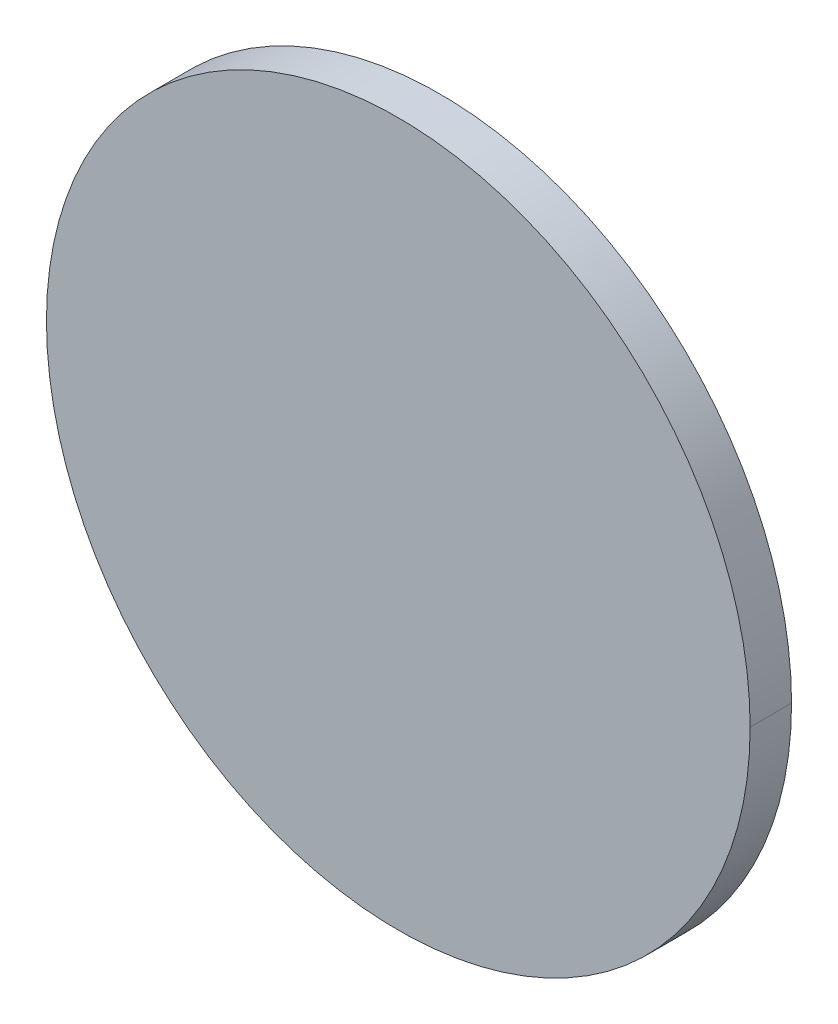
ISO-10303-21;
HEADER;
FILE_DESCRIPTION(('STEP AP214'),'2;1');
FILE_NAME('part.step','',(''),(''),'','','');
FILE_SCHEMA(('AUTOMOTIVE_DESIGN { 1 0 10303 214 1 1 1 1 }'));
ENDSEC;
DATA;
#1=APPLICATION_CONTEXT('core data for automotive mechanical design processes');
#2=APPLICATION_PROTOCOL_DEFINITION('international standard','automotive_design',2000,#1);
#3=PRODUCT_CONTEXT('',#1,'mechanical');
#4=PRODUCT('Part','Part','',(#3));
#5=PRODUCT_RELATED_PRODUCT_CATEGORY('part','',(#4));
#6=PRODUCT_DEFINITION_FORMATION('','',#4);
#7=PRODUCT_DEFINITION_CONTEXT('part definition',#1,'design');
#8=PRODUCT_DEFINITION('design','',#6,#7);
#9=PRODUCT_DEFINITION_SHAPE('','',#8);
#10=(LENGTH_UNIT() NAMED_UNIT(*) SI_UNIT(.MILLI.,.METRE.));
#11=(NAMED_UNIT(*) PLANE_ANGLE_UNIT() SI_UNIT($,.RADIAN.));
#12=(NAMED_UNIT(*) SI_UNIT($,.STERADIAN.) SOLID_ANGLE_UNIT());
#13=UNCERTAINTY_MEASURE_WITH_UNIT(LENGTH_MEASURE(1.E-05),#10,'distance_accuracy_value','');
#14=(GEOMETRIC_REPRESENTATION_CONTEXT(3) GLOBAL_UNCERTAINTY_ASSIGNED_CONTEXT((#13)) GLOBAL_UNIT_ASSIGNED_CONTEXT((#10,
#11,#12)) REPRESENTATION_CONTEXT('',''));
#15=CARTESIAN_POINT('',(0.,0.,0.));
#16=DIRECTION('',(0.,0.,1.));
#17=DIRECTION('',(1.,0.,0.));
#18=AXIS2_PLACEMENT_3D('',#15,#16,#17);
#19=CARTESIAN_POINT('',(24.65,20.,12.5208152801713));
#20=DIRECTION('',(0.,0.,-1.));
#21=DIRECTION('',(-1.,0.,0.));
#22=AXIS2_PLACEMENT_3D('',#19,#20,#21);
#23=CYLINDRICAL_SURFACE('',#22,4.25);
#24=CARTESIAN_POINT('',(24.65,20.,0.5));
#25=DIRECTION('',(0.,0.,-1.));
#26=DIRECTION('',(-1.,0.,0.));
#27=AXIS2_PLACEMENT_3D('',#24,#25,#26);
#28=CIRCLE('',#27,4.25);
#29=CARTESIAN_POINT('',(20.4,20.,0.5));
#30=VERTEX_POINT('',#29);
#31=CARTESIAN_POINT('',(28.9,20.,0.5));
#32=VERTEX_POINT('',#31);
#33=EDGE_CURVE('E11',#30,#32,#28,.T.);
#34=ORIENTED_EDGE('',*,*,#33,.T.);
#35=DIRECTION('',(0.,0.,-1.));
#36=VECTOR('',#35,1.);
#37=CARTESIAN_POINT('',(28.9,20.,12.5208152801713));
#38=LINE('',#37,#36);
#39=CARTESIAN_POINT('',(28.9,20.,0.));
#40=VERTEX_POINT('',#39);
#41=EDGE_CURVE('E27',#32,#40,#38,.T.);
#42=ORIENTED_EDGE('',*,*,#41,.T.);
#43=CARTESIAN_POINT('',(24.65,20.,0.));
#44=DIRECTION('',(0.,0.,1.));
#45=DIRECTION('',(1.,0.,0.));
#46=AXIS2_PLACEMENT_3D('',#43,#44,#45);
#47=CIRCLE('',#46,4.25);
#48=CARTESIAN_POINT('',(20.4,20.,0.));
#49=VERTEX_POINT('',#48);
#50=EDGE_CURVE('E60',#40,#49,#47,.T.);
#51=ORIENTED_EDGE('',*,*,#50,.T.);
#52=DIRECTION('',(0.,0.,-1.));
#53=VECTOR('',#52,1.);
#54=CARTESIAN_POINT('',(20.4,20.,12.5208152801713));
#55=LINE('',#54,#53);
#56=EDGE_CURVE('E50',#30,#49,#55,.T.);
#57=ORIENTED_EDGE('',*,*,#56,.F.);
#58=EDGE_LOOP('',(#34,#42,#51,#57));
#59=FACE_BOUND('',#58,.T.);
#60=ADVANCED_FACE('F16',(#59),#23,.T.);
#61=CARTESIAN_POINT('',(24.65,20.,0.));
#62=DIRECTION('',(0.,0.,1.));
#63=DIRECTION('',(1.,0.,0.));
#64=AXIS2_PLACEMENT_3D('',#61,#62,#63);
#65=PLANE('',#64);
#66=CARTESIAN_POINT('',(24.65,20.,0.));
#67=DIRECTION('',(0.,0.,1.));
#68=DIRECTION('',(1.,0.,0.));
#69=AXIS2_PLACEMENT_3D('',#66,#67,#68);
#70=CIRCLE('',#69,4.25);
#71=EDGE_CURVE('E54',#49,#40,#70,.T.);
#72=ORIENTED_EDGE('',*,*,#71,.F.);
#73=ORIENTED_EDGE('',*,*,#50,.F.);
#74=EDGE_LOOP('',(#72,#73));
#75=FACE_BOUND('',#74,.T.);
#76=ADVANCED_FACE('F18',(#75),#65,.F.);
#77=CARTESIAN_POINT('',(24.65,20.,12.5208152801713));
#78=DIRECTION('',(0.,0.,-1.));
#79=DIRECTION('',(-1.,0.,0.));
#80=AXIS2_PLACEMENT_3D('',#77,#78,#79);
#81=CYLINDRICAL_SURFACE('',#80,4.25);
#82=ORIENTED_EDGE('',*,*,#41,.F.);
#83=CARTESIAN_POINT('',(24.65,20.,0.5));
#84=DIRECTION('',(0.,0.,-1.));
#85=DIRECTION('',(-1.,0.,0.));
#86=AXIS2_PLACEMENT_3D('',#83,#84,#85);
#87=CIRCLE('',#86,4.25);
#88=EDGE_CURVE('E20',#32,#30,#87,.T.);
#89=ORIENTED_EDGE('',*,*,#88,.T.);
#90=ORIENTED_EDGE('',*,*,#56,.T.);
#91=ORIENTED_EDGE('',*,*,#71,.T.);
#92=EDGE_LOOP('',(#82,#89,#90,#91));
#93=FACE_BOUND('',#92,.T.);
#94=ADVANCED_FACE('F52',(#93),#81,.T.);
#95=CARTESIAN_POINT('',(0.,0.,0.5));
#96=DIRECTION('',(0.,0.,-1.));
#97=DIRECTION('',(0.,-1.,0.));
#98=AXIS2_PLACEMENT_3D('',#95,#96,#97);
#99=PLANE('',#98);
#100=ORIENTED_EDGE('',*,*,#33,.F.);
#101=ORIENTED_EDGE('',*,*,#88,.F.);
#102=EDGE_LOOP('',(#100,#101));
#103=FACE_BOUND('',#102,.T.);
#104=ADVANCED_FACE('F112',(#103),#99,.F.);
#105=CLOSED_SHELL('',(#60,#76,#94,#104));
#106=MANIFOLD_SOLID_BREP('B1',#105);
#107=ADVANCED_BREP_SHAPE_REPRESENTATION('',(#18,#106),#14);
#108=SHAPE_DEFINITION_REPRESENTATION(#9,#107);
ENDSEC;
END-ISO-10303-21;
